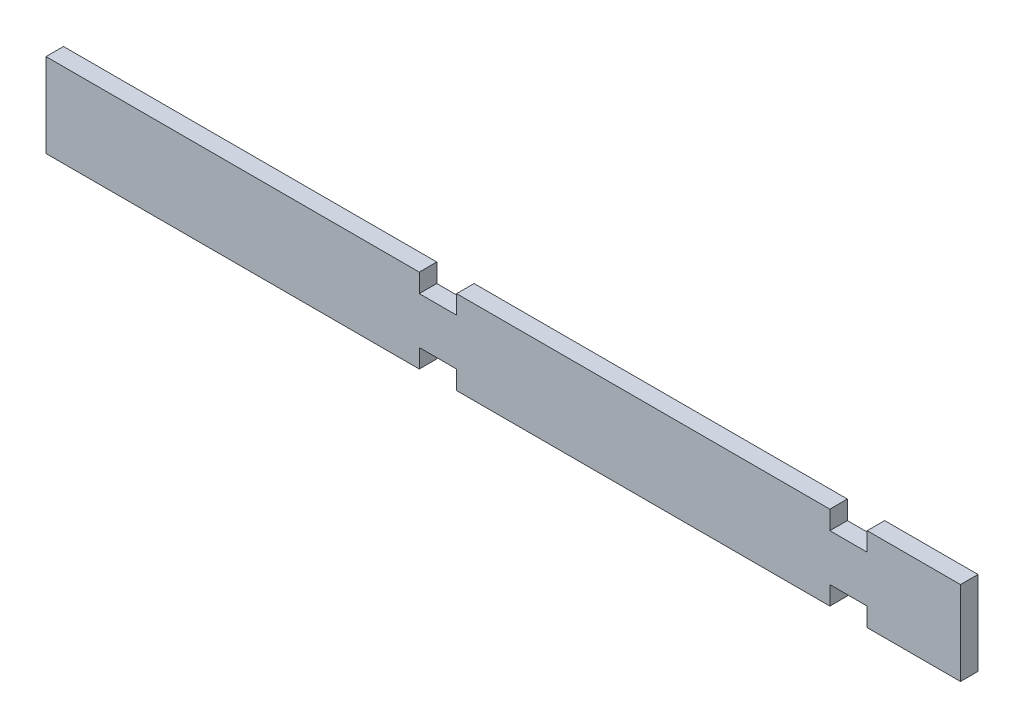
ISO-10303-21;
HEADER;
FILE_DESCRIPTION(('STEP AP214'),'2;1');
FILE_NAME('part.step','',(''),(''),'','','');
FILE_SCHEMA(('AUTOMOTIVE_DESIGN { 1 0 10303 214 1 1 1 1 }'));
ENDSEC;
DATA;
#1=APPLICATION_CONTEXT('core data for automotive mechanical design processes');
#2=APPLICATION_PROTOCOL_DEFINITION('international standard','automotive_design',2000,#1);
#3=PRODUCT_CONTEXT('',#1,'mechanical');
#4=PRODUCT('Part','Part','',(#3));
#5=PRODUCT_RELATED_PRODUCT_CATEGORY('part','',(#4));
#6=PRODUCT_DEFINITION_FORMATION('','',#4);
#7=PRODUCT_DEFINITION_CONTEXT('part definition',#1,'design');
#8=PRODUCT_DEFINITION('design','',#6,#7);
#9=PRODUCT_DEFINITION_SHAPE('','',#8);
#10=(LENGTH_UNIT() NAMED_UNIT(*) SI_UNIT(.MILLI.,.METRE.));
#11=(NAMED_UNIT(*) PLANE_ANGLE_UNIT() SI_UNIT($,.RADIAN.));
#12=(NAMED_UNIT(*) SI_UNIT($,.STERADIAN.) SOLID_ANGLE_UNIT());
#13=UNCERTAINTY_MEASURE_WITH_UNIT(LENGTH_MEASURE(1.E-05),#10,'distance_accuracy_value','');
#14=(GEOMETRIC_REPRESENTATION_CONTEXT(3) GLOBAL_UNCERTAINTY_ASSIGNED_CONTEXT((#13)) GLOBAL_UNIT_ASSIGNED_CONTEXT((#10,
#11,#12)) REPRESENTATION_CONTEXT('',''));
#15=CARTESIAN_POINT('',(0.,0.,0.));
#16=DIRECTION('',(0.,0.,1.));
#17=DIRECTION('',(1.,0.,0.));
#18=AXIS2_PLACEMENT_3D('',#15,#16,#17);
#19=CARTESIAN_POINT('',(0.,-5.71500000000001,1.190625));
#20=DIRECTION('',(0.,1.,0.));
#21=DIRECTION('',(-1.,0.,0.));
#22=AXIS2_PLACEMENT_3D('',#19,#20,#21);
#23=PLANE('',#22);
#24=DIRECTION('',(1.,0.,0.));
#25=VECTOR('',#24,1.);
#26=CARTESIAN_POINT('',(0.,-5.71500000000001,-1.190625));
#27=LINE('',#26,#25);
#28=CARTESIAN_POINT('',(-62.23,-5.71500000000001,-1.190625));
#29=VERTEX_POINT('',#28);
#30=CARTESIAN_POINT('',(-11.43,-5.71500000000001,-1.190625));
#31=VERTEX_POINT('',#30);
#32=EDGE_CURVE('E356',#29,#31,#27,.T.);
#33=ORIENTED_EDGE('',*,*,#32,.T.);
#34=DIRECTION('',(0.,0.,-1.));
#35=VECTOR('',#34,1.);
#36=CARTESIAN_POINT('',(-11.43,-5.71500000000001,1.190625));
#37=LINE('',#36,#35);
#38=CARTESIAN_POINT('',(-11.43,-5.71500000000001,1.190625));
#39=VERTEX_POINT('',#38);
#40=EDGE_CURVE('E11',#39,#31,#37,.T.);
#41=ORIENTED_EDGE('',*,*,#40,.F.);
#42=DIRECTION('',(1.,0.,0.));
#43=VECTOR('',#42,1.);
#44=CARTESIAN_POINT('',(0.,-5.71500000000001,1.190625));
#45=LINE('',#44,#43);
#46=CARTESIAN_POINT('',(-62.23,-5.71500000000001,1.190625));
#47=VERTEX_POINT('',#46);
#48=EDGE_CURVE('E239',#47,#39,#45,.T.);
#49=ORIENTED_EDGE('',*,*,#48,.F.);
#50=DIRECTION('',(0.,0.,-1.));
#51=VECTOR('',#50,1.);
#52=CARTESIAN_POINT('',(-62.23,-5.71500000000001,1.190625));
#53=LINE('',#52,#51);
#54=EDGE_CURVE('E61',#47,#29,#53,.T.);
#55=ORIENTED_EDGE('',*,*,#54,.T.);
#56=EDGE_LOOP('',(#33,#41,#49,#55));
#57=FACE_BOUND('',#56,.T.);
#58=ADVANCED_FACE('F43',(#57),#23,.F.);
#59=CARTESIAN_POINT('',(-11.43,0.,1.190625));
#60=DIRECTION('',(-1.,0.,0.));
#61=DIRECTION('',(0.,0.,1.));
#62=AXIS2_PLACEMENT_3D('',#59,#60,#61);
#63=PLANE('',#62);
#64=DIRECTION('',(0.,1.,0.));
#65=VECTOR('',#64,1.);
#66=CARTESIAN_POINT('',(-11.43,0.,-1.190625));
#67=LINE('',#66,#65);
#68=CARTESIAN_POINT('',(-11.43,-3.175,-1.190625));
#69=VERTEX_POINT('',#68);
#70=EDGE_CURVE('E348',#31,#69,#67,.T.);
#71=ORIENTED_EDGE('',*,*,#70,.T.);
#72=DIRECTION('',(0.,0.,-1.));
#73=VECTOR('',#72,1.);
#74=CARTESIAN_POINT('',(-11.43,-3.175,1.190625));
#75=LINE('',#74,#73);
#76=CARTESIAN_POINT('',(-11.43,-3.175,1.190625));
#77=VERTEX_POINT('',#76);
#78=EDGE_CURVE('E53',#77,#69,#75,.T.);
#79=ORIENTED_EDGE('',*,*,#78,.F.);
#80=DIRECTION('',(0.,1.,0.));
#81=VECTOR('',#80,1.);
#82=CARTESIAN_POINT('',(-11.43,0.,1.190625));
#83=LINE('',#82,#81);
#84=EDGE_CURVE('E135',#39,#77,#83,.T.);
#85=ORIENTED_EDGE('',*,*,#84,.F.);
#86=ORIENTED_EDGE('',*,*,#40,.T.);
#87=EDGE_LOOP('',(#71,#79,#85,#86));
#88=FACE_BOUND('',#87,.T.);
#89=ADVANCED_FACE('F45',(#88),#63,.F.);
#90=CARTESIAN_POINT('',(0.,-3.175,1.190625));
#91=DIRECTION('',(0.,1.,0.));
#92=DIRECTION('',(0.,0.,1.));
#93=AXIS2_PLACEMENT_3D('',#90,#91,#92);
#94=PLANE('',#93);
#95=DIRECTION('',(1.,0.,0.));
#96=VECTOR('',#95,1.);
#97=CARTESIAN_POINT('',(0.,-3.175,-1.190625));
#98=LINE('',#97,#96);
#99=CARTESIAN_POINT('',(-6.35000000000002,-3.175,-1.190625));
#100=VERTEX_POINT('',#99);
#101=EDGE_CURVE('E344',#69,#100,#98,.T.);
#102=ORIENTED_EDGE('',*,*,#101,.T.);
#103=DIRECTION('',(0.,0.,-1.));
#104=VECTOR('',#103,1.);
#105=CARTESIAN_POINT('',(-6.35000000000002,-3.175,1.190625));
#106=LINE('',#105,#104);
#107=CARTESIAN_POINT('',(-6.35000000000002,-3.175,1.190625));
#108=VERTEX_POINT('',#107);
#109=EDGE_CURVE('E334',#108,#100,#106,.T.);
#110=ORIENTED_EDGE('',*,*,#109,.F.);
#111=DIRECTION('',(1.,0.,0.));
#112=VECTOR('',#111,1.);
#113=CARTESIAN_POINT('',(0.,-3.175,1.190625));
#114=LINE('',#113,#112);
#115=EDGE_CURVE('E254',#77,#108,#114,.T.);
#116=ORIENTED_EDGE('',*,*,#115,.F.);
#117=ORIENTED_EDGE('',*,*,#78,.T.);
#118=EDGE_LOOP('',(#102,#110,#116,#117));
#119=FACE_BOUND('',#118,.T.);
#120=ADVANCED_FACE('F342',(#119),#94,.F.);
#121=CARTESIAN_POINT('',(-6.35000000000002,0.,1.190625));
#122=DIRECTION('',(-1.,0.,0.));
#123=DIRECTION('',(0.,0.,1.));
#124=AXIS2_PLACEMENT_3D('',#121,#122,#123);
#125=PLANE('',#124);
#126=DIRECTION('',(0.,1.,0.));
#127=VECTOR('',#126,1.);
#128=CARTESIAN_POINT('',(-6.35000000000002,0.,-1.190625));
#129=LINE('',#128,#127);
#130=CARTESIAN_POINT('',(-6.35000000000002,-5.71500000000001,-1.190625));
#131=VERTEX_POINT('',#130);
#132=EDGE_CURVE('E350',#131,#100,#129,.T.);
#133=ORIENTED_EDGE('',*,*,#132,.F.);
#134=DIRECTION('',(0.,0.,-1.));
#135=VECTOR('',#134,1.);
#136=CARTESIAN_POINT('',(-6.35000000000002,-5.71500000000001,1.190625));
#137=LINE('',#136,#135);
#138=CARTESIAN_POINT('',(-6.35000000000002,-5.71500000000001,1.190625));
#139=VERTEX_POINT('',#138);
#140=EDGE_CURVE('E280',#139,#131,#137,.T.);
#141=ORIENTED_EDGE('',*,*,#140,.F.);
#142=DIRECTION('',(0.,1.,0.));
#143=VECTOR('',#142,1.);
#144=CARTESIAN_POINT('',(-6.35000000000002,0.,1.190625));
#145=LINE('',#144,#143);
#146=EDGE_CURVE('E250',#139,#108,#145,.T.);
#147=ORIENTED_EDGE('',*,*,#146,.T.);
#148=ORIENTED_EDGE('',*,*,#109,.T.);
#149=EDGE_LOOP('',(#133,#141,#147,#148));
#150=FACE_BOUND('',#149,.T.);
#151=ADVANCED_FACE('F465',(#150),#125,.T.);
#152=CARTESIAN_POINT('',(44.45,-5.715,-1.190625));
#153=VERTEX_POINT('',#152);
#154=EDGE_CURVE('E276',#131,#153,#27,.T.);
#155=ORIENTED_EDGE('',*,*,#154,.T.);
#156=DIRECTION('',(0.,0.,-1.));
#157=VECTOR('',#156,1.);
#158=CARTESIAN_POINT('',(44.45,-5.715,1.190625));
#159=LINE('',#158,#157);
#160=CARTESIAN_POINT('',(44.45,-5.715,1.190625));
#161=VERTEX_POINT('',#160);
#162=EDGE_CURVE('E273',#161,#153,#159,.T.);
#163=ORIENTED_EDGE('',*,*,#162,.F.);
#164=EDGE_CURVE('E238',#139,#161,#45,.T.);
#165=ORIENTED_EDGE('',*,*,#164,.F.);
#166=ORIENTED_EDGE('',*,*,#140,.T.);
#167=EDGE_LOOP('',(#155,#163,#165,#166));
#168=FACE_BOUND('',#167,.T.);
#169=ADVANCED_FACE('F274',(#168),#23,.F.);
#170=CARTESIAN_POINT('',(44.45,-1.21430643318376E-13,1.190625));
#171=DIRECTION('',(-1.,0.,0.));
#172=DIRECTION('',(0.,-1.,0.));
#173=AXIS2_PLACEMENT_3D('',#170,#171,#172);
#174=PLANE('',#173);
#175=DIRECTION('',(0.,1.,0.));
#176=VECTOR('',#175,1.);
#177=CARTESIAN_POINT('',(44.45,-1.21430643318376E-13,-1.190625));
#178=LINE('',#177,#176);
#179=CARTESIAN_POINT('',(44.45,-3.175,-1.190625));
#180=VERTEX_POINT('',#179);
#181=EDGE_CURVE('E286',#153,#180,#178,.T.);
#182=ORIENTED_EDGE('',*,*,#181,.T.);
#183=DIRECTION('',(0.,0.,-1.));
#184=VECTOR('',#183,1.);
#185=CARTESIAN_POINT('',(44.45,-3.175,1.190625));
#186=LINE('',#185,#184);
#187=CARTESIAN_POINT('',(44.45,-3.175,1.190625));
#188=VERTEX_POINT('',#187);
#189=EDGE_CURVE('E281',#188,#180,#186,.T.);
#190=ORIENTED_EDGE('',*,*,#189,.F.);
#191=DIRECTION('',(0.,1.,0.));
#192=VECTOR('',#191,1.);
#193=CARTESIAN_POINT('',(44.45,-1.21430643318376E-13,1.190625));
#194=LINE('',#193,#192);
#195=EDGE_CURVE('E247',#161,#188,#194,.T.);
#196=ORIENTED_EDGE('',*,*,#195,.F.);
#197=ORIENTED_EDGE('',*,*,#162,.T.);
#198=EDGE_LOOP('',(#182,#190,#196,#197));
#199=FACE_BOUND('',#198,.T.);
#200=ADVANCED_FACE('F283',(#199),#174,.F.);
#201=CARTESIAN_POINT('',(0.,-3.175,1.190625));
#202=DIRECTION('',(0.,1.,0.));
#203=DIRECTION('',(0.,0.,1.));
#204=AXIS2_PLACEMENT_3D('',#201,#202,#203);
#205=PLANE('',#204);
#206=DIRECTION('',(1.,0.,0.));
#207=VECTOR('',#206,1.);
#208=CARTESIAN_POINT('',(0.,-3.175,-1.190625));
#209=LINE('',#208,#207);
#210=CARTESIAN_POINT('',(49.53,-3.175,-1.190625));
#211=VERTEX_POINT('',#210);
#212=EDGE_CURVE('E362',#180,#211,#209,.T.);
#213=ORIENTED_EDGE('',*,*,#212,.T.);
#214=DIRECTION('',(0.,0.,-1.));
#215=VECTOR('',#214,1.);
#216=CARTESIAN_POINT('',(49.53,-3.175,1.190625));
#217=LINE('',#216,#215);
#218=CARTESIAN_POINT('',(49.53,-3.175,1.190625));
#219=VERTEX_POINT('',#218);
#220=EDGE_CURVE('E291',#219,#211,#217,.T.);
#221=ORIENTED_EDGE('',*,*,#220,.F.);
#222=DIRECTION('',(1.,0.,0.));
#223=VECTOR('',#222,1.);
#224=CARTESIAN_POINT('',(0.,-3.175,1.190625));
#225=LINE('',#224,#223);
#226=EDGE_CURVE('E244',#188,#219,#225,.T.);
#227=ORIENTED_EDGE('',*,*,#226,.F.);
#228=ORIENTED_EDGE('',*,*,#189,.T.);
#229=EDGE_LOOP('',(#213,#221,#227,#228));
#230=FACE_BOUND('',#229,.T.);
#231=ADVANCED_FACE('F294',(#230),#205,.F.);
#232=CARTESIAN_POINT('',(49.53,-1.35308431126191E-13,1.190625));
#233=DIRECTION('',(-1.,0.,0.));
#234=DIRECTION('',(0.,-1.,0.));
#235=AXIS2_PLACEMENT_3D('',#232,#233,#234);
#236=PLANE('',#235);
#237=DIRECTION('',(0.,1.,0.));
#238=VECTOR('',#237,1.);
#239=CARTESIAN_POINT('',(49.53,-1.35308431126191E-13,-1.190625));
#240=LINE('',#239,#238);
#241=CARTESIAN_POINT('',(49.53,-5.715,-1.190625));
#242=VERTEX_POINT('',#241);
#243=EDGE_CURVE('E303',#242,#211,#240,.T.);
#244=ORIENTED_EDGE('',*,*,#243,.F.);
#245=DIRECTION('',(0.,0.,-1.));
#246=VECTOR('',#245,1.);
#247=CARTESIAN_POINT('',(49.53,-5.715,1.190625));
#248=LINE('',#247,#246);
#249=CARTESIAN_POINT('',(49.53,-5.715,1.190625));
#250=VERTEX_POINT('',#249);
#251=EDGE_CURVE('E301',#250,#242,#248,.T.);
#252=ORIENTED_EDGE('',*,*,#251,.F.);
#253=DIRECTION('',(0.,1.,0.));
#254=VECTOR('',#253,1.);
#255=CARTESIAN_POINT('',(49.53,-1.35308431126191E-13,1.190625));
#256=LINE('',#255,#254);
#257=EDGE_CURVE('E236',#250,#219,#256,.T.);
#258=ORIENTED_EDGE('',*,*,#257,.T.);
#259=ORIENTED_EDGE('',*,*,#220,.T.);
#260=EDGE_LOOP('',(#244,#252,#258,#259));
#261=FACE_BOUND('',#260,.T.);
#262=ADVANCED_FACE('F300',(#261),#236,.T.);
#263=CARTESIAN_POINT('',(62.23,-5.715,-1.190625));
#264=VERTEX_POINT('',#263);
#265=EDGE_CURVE('E311',#242,#264,#27,.T.);
#266=ORIENTED_EDGE('',*,*,#265,.T.);
#267=DIRECTION('',(0.,0.,-1.));
#268=VECTOR('',#267,1.);
#269=CARTESIAN_POINT('',(62.23,-5.715,1.190625));
#270=LINE('',#269,#268);
#271=CARTESIAN_POINT('',(62.23,-5.715,1.190625));
#272=VERTEX_POINT('',#271);
#273=EDGE_CURVE('E307',#272,#264,#270,.T.);
#274=ORIENTED_EDGE('',*,*,#273,.F.);
#275=EDGE_CURVE('E232',#250,#272,#45,.T.);
#276=ORIENTED_EDGE('',*,*,#275,.F.);
#277=ORIENTED_EDGE('',*,*,#251,.T.);
#278=EDGE_LOOP('',(#266,#274,#276,#277));
#279=FACE_BOUND('',#278,.T.);
#280=ADVANCED_FACE('F309',(#279),#23,.F.);
#281=CARTESIAN_POINT('',(62.23,0.,1.190625));
#282=DIRECTION('',(-1.,0.,0.));
#283=DIRECTION('',(0.,0.,1.));
#284=AXIS2_PLACEMENT_3D('',#281,#282,#283);
#285=PLANE('',#284);
#286=DIRECTION('',(0.,1.,0.));
#287=VECTOR('',#286,1.);
#288=CARTESIAN_POINT('',(62.23,0.,-1.190625));
#289=LINE('',#288,#287);
#290=CARTESIAN_POINT('',(62.23,5.715,-1.190625));
#291=VERTEX_POINT('',#290);
#292=EDGE_CURVE('E319',#264,#291,#289,.T.);
#293=ORIENTED_EDGE('',*,*,#292,.T.);
#294=DIRECTION('',(0.,0.,-1.));
#295=VECTOR('',#294,1.);
#296=CARTESIAN_POINT('',(62.23,5.715,1.190625));
#297=LINE('',#296,#295);
#298=CARTESIAN_POINT('',(62.23,5.715,1.190625));
#299=VERTEX_POINT('',#298);
#300=EDGE_CURVE('E316',#299,#291,#297,.T.);
#301=ORIENTED_EDGE('',*,*,#300,.F.);
#302=DIRECTION('',(0.,1.,0.));
#303=VECTOR('',#302,1.);
#304=CARTESIAN_POINT('',(62.23,0.,1.190625));
#305=LINE('',#304,#303);
#306=EDGE_CURVE('E226',#272,#299,#305,.T.);
#307=ORIENTED_EDGE('',*,*,#306,.F.);
#308=ORIENTED_EDGE('',*,*,#273,.T.);
#309=EDGE_LOOP('',(#293,#301,#307,#308));
#310=FACE_BOUND('',#309,.T.);
#311=ADVANCED_FACE('F318',(#310),#285,.F.);
#312=CARTESIAN_POINT('',(0.,5.715,1.190625));
#313=DIRECTION('',(0.,1.,0.));
#314=DIRECTION('',(0.,0.,1.));
#315=AXIS2_PLACEMENT_3D('',#312,#313,#314);
#316=PLANE('',#315);
#317=DIRECTION('',(1.,0.,0.));
#318=VECTOR('',#317,1.);
#319=CARTESIAN_POINT('',(0.,5.715,-1.190625));
#320=LINE('',#319,#318);
#321=CARTESIAN_POINT('',(49.53,5.715,-1.190625));
#322=VERTEX_POINT('',#321);
#323=EDGE_CURVE('E369',#322,#291,#320,.T.);
#324=ORIENTED_EDGE('',*,*,#323,.F.);
#325=DIRECTION('',(0.,0.,-1.));
#326=VECTOR('',#325,1.);
#327=CARTESIAN_POINT('',(49.53,5.715,1.190625));
#328=LINE('',#327,#326);
#329=CARTESIAN_POINT('',(49.53,5.715,1.190625));
#330=VERTEX_POINT('',#329);
#331=EDGE_CURVE('E323',#330,#322,#328,.T.);
#332=ORIENTED_EDGE('',*,*,#331,.F.);
#333=DIRECTION('',(1.,0.,0.));
#334=VECTOR('',#333,1.);
#335=CARTESIAN_POINT('',(0.,5.715,1.190625));
#336=LINE('',#335,#334);
#337=EDGE_CURVE('E214',#330,#299,#336,.T.);
#338=ORIENTED_EDGE('',*,*,#337,.T.);
#339=ORIENTED_EDGE('',*,*,#300,.T.);
#340=EDGE_LOOP('',(#324,#332,#338,#339));
#341=FACE_BOUND('',#340,.T.);
#342=ADVANCED_FACE('F454',(#341),#316,.T.);
#343=CARTESIAN_POINT('',(49.53,1.35308431126191E-13,1.190625));
#344=DIRECTION('',(1.,0.,0.));
#345=DIRECTION('',(0.,1.,0.));
#346=AXIS2_PLACEMENT_3D('',#343,#344,#345);
#347=PLANE('',#346);
#348=DIRECTION('',(0.,-1.,0.));
#349=VECTOR('',#348,1.);
#350=CARTESIAN_POINT('',(49.53,1.35308431126191E-13,-1.190625));
#351=LINE('',#350,#349);
#352=CARTESIAN_POINT('',(49.53,3.175,-1.190625));
#353=VERTEX_POINT('',#352);
#354=EDGE_CURVE('E372',#322,#353,#351,.T.);
#355=ORIENTED_EDGE('',*,*,#354,.T.);
#356=DIRECTION('',(0.,0.,-1.));
#357=VECTOR('',#356,1.);
#358=CARTESIAN_POINT('',(49.53,3.175,1.190625));
#359=LINE('',#358,#357);
#360=CARTESIAN_POINT('',(49.53,3.175,1.190625));
#361=VERTEX_POINT('',#360);
#362=EDGE_CURVE('E326',#361,#353,#359,.T.);
#363=ORIENTED_EDGE('',*,*,#362,.F.);
#364=DIRECTION('',(0.,-1.,0.));
#365=VECTOR('',#364,1.);
#366=CARTESIAN_POINT('',(49.53,1.35308431126191E-13,1.190625));
#367=LINE('',#366,#365);
#368=EDGE_CURVE('E225',#330,#361,#367,.T.);
#369=ORIENTED_EDGE('',*,*,#368,.F.);
#370=ORIENTED_EDGE('',*,*,#331,.T.);
#371=EDGE_LOOP('',(#355,#363,#369,#370));
#372=FACE_BOUND('',#371,.T.);
#373=ADVANCED_FACE('F422',(#372),#347,.F.);
#374=CARTESIAN_POINT('',(0.,3.175,1.190625));
#375=DIRECTION('',(0.,1.,0.));
#376=DIRECTION('',(0.,0.,1.));
#377=AXIS2_PLACEMENT_3D('',#374,#375,#376);
#378=PLANE('',#377);
#379=DIRECTION('',(1.,0.,0.));
#380=VECTOR('',#379,1.);
#381=CARTESIAN_POINT('',(0.,3.175,-1.190625));
#382=LINE('',#381,#380);
#383=CARTESIAN_POINT('',(44.45,3.175,-1.190625));
#384=VERTEX_POINT('',#383);
#385=EDGE_CURVE('E377',#384,#353,#382,.T.);
#386=ORIENTED_EDGE('',*,*,#385,.F.);
#387=DIRECTION('',(0.,0.,-1.));
#388=VECTOR('',#387,1.);
#389=CARTESIAN_POINT('',(44.45,3.175,1.190625));
#390=LINE('',#389,#388);
#391=CARTESIAN_POINT('',(44.45,3.175,1.190625));
#392=VERTEX_POINT('',#391);
#393=EDGE_CURVE('E410',#392,#384,#390,.T.);
#394=ORIENTED_EDGE('',*,*,#393,.F.);
#395=DIRECTION('',(1.,0.,0.));
#396=VECTOR('',#395,1.);
#397=CARTESIAN_POINT('',(0.,3.175,1.190625));
#398=LINE('',#397,#396);
#399=EDGE_CURVE('E231',#392,#361,#398,.T.);
#400=ORIENTED_EDGE('',*,*,#399,.T.);
#401=ORIENTED_EDGE('',*,*,#362,.T.);
#402=EDGE_LOOP('',(#386,#394,#400,#401));
#403=FACE_BOUND('',#402,.T.);
#404=ADVANCED_FACE('F417',(#403),#378,.T.);
#405=CARTESIAN_POINT('',(44.45,1.21430643318376E-13,1.190625));
#406=DIRECTION('',(1.,0.,0.));
#407=DIRECTION('',(0.,1.,0.));
#408=AXIS2_PLACEMENT_3D('',#405,#406,#407);
#409=PLANE('',#408);
#410=DIRECTION('',(0.,-1.,0.));
#411=VECTOR('',#410,1.);
#412=CARTESIAN_POINT('',(44.45,1.21430643318376E-13,-1.190625));
#413=LINE('',#412,#411);
#414=CARTESIAN_POINT('',(44.45,5.715,-1.190625));
#415=VERTEX_POINT('',#414);
#416=EDGE_CURVE('E381',#415,#384,#413,.T.);
#417=ORIENTED_EDGE('',*,*,#416,.F.);
#418=DIRECTION('',(0.,0.,-1.));
#419=VECTOR('',#418,1.);
#420=CARTESIAN_POINT('',(44.45,5.715,1.190625));
#421=LINE('',#420,#419);
#422=CARTESIAN_POINT('',(44.45,5.715,1.190625));
#423=VERTEX_POINT('',#422);
#424=EDGE_CURVE('E407',#423,#415,#421,.T.);
#425=ORIENTED_EDGE('',*,*,#424,.F.);
#426=DIRECTION('',(0.,-1.,0.));
#427=VECTOR('',#426,1.);
#428=CARTESIAN_POINT('',(44.45,1.21430643318376E-13,1.190625));
#429=LINE('',#428,#427);
#430=EDGE_CURVE('E222',#423,#392,#429,.T.);
#431=ORIENTED_EDGE('',*,*,#430,.T.);
#432=ORIENTED_EDGE('',*,*,#393,.T.);
#433=EDGE_LOOP('',(#417,#425,#431,#432));
#434=FACE_BOUND('',#433,.T.);
#435=ADVANCED_FACE('F428',(#434),#409,.T.);
#436=CARTESIAN_POINT('',(-6.35000000000002,5.715,-1.190625));
#437=VERTEX_POINT('',#436);
#438=EDGE_CURVE('E373',#437,#415,#320,.T.);
#439=ORIENTED_EDGE('',*,*,#438,.F.);
#440=DIRECTION('',(0.,0.,-1.));
#441=VECTOR('',#440,1.);
#442=CARTESIAN_POINT('',(-6.35000000000002,5.715,1.190625));
#443=LINE('',#442,#441);
#444=CARTESIAN_POINT('',(-6.35000000000002,5.715,1.190625));
#445=VERTEX_POINT('',#444);
#446=EDGE_CURVE('E404',#445,#437,#443,.T.);
#447=ORIENTED_EDGE('',*,*,#446,.F.);
#448=EDGE_CURVE('E213',#445,#423,#336,.T.);
#449=ORIENTED_EDGE('',*,*,#448,.T.);
#450=ORIENTED_EDGE('',*,*,#424,.T.);
#451=EDGE_LOOP('',(#439,#447,#449,#450));
#452=FACE_BOUND('',#451,.T.);
#453=ADVANCED_FACE('F455',(#452),#316,.T.);
#454=CARTESIAN_POINT('',(-6.35000000000002,0.,1.190625));
#455=DIRECTION('',(1.,0.,0.));
#456=DIRECTION('',(0.,0.,-1.));
#457=AXIS2_PLACEMENT_3D('',#454,#455,#456);
#458=PLANE('',#457);
#459=DIRECTION('',(0.,-1.,0.));
#460=VECTOR('',#459,1.);
#461=CARTESIAN_POINT('',(-6.35000000000002,0.,-1.190625));
#462=LINE('',#461,#460);
#463=CARTESIAN_POINT('',(-6.35000000000002,3.175,-1.190625));
#464=VERTEX_POINT('',#463);
#465=EDGE_CURVE('E385',#437,#464,#462,.T.);
#466=ORIENTED_EDGE('',*,*,#465,.T.);
#467=DIRECTION('',(0.,0.,-1.));
#468=VECTOR('',#467,1.);
#469=CARTESIAN_POINT('',(-6.35000000000002,3.175,1.190625));
#470=LINE('',#469,#468);
#471=CARTESIAN_POINT('',(-6.35000000000002,3.175,1.190625));
#472=VERTEX_POINT('',#471);
#473=EDGE_CURVE('E401',#472,#464,#470,.T.);
#474=ORIENTED_EDGE('',*,*,#473,.F.);
#475=DIRECTION('',(0.,-1.,0.));
#476=VECTOR('',#475,1.);
#477=CARTESIAN_POINT('',(-6.35000000000002,0.,1.190625));
#478=LINE('',#477,#476);
#479=EDGE_CURVE('E221',#445,#472,#478,.T.);
#480=ORIENTED_EDGE('',*,*,#479,.F.);
#481=ORIENTED_EDGE('',*,*,#446,.T.);
#482=EDGE_LOOP('',(#466,#474,#480,#481));
#483=FACE_BOUND('',#482,.T.);
#484=ADVANCED_FACE('F563',(#483),#458,.F.);
#485=CARTESIAN_POINT('',(0.,3.175,1.190625));
#486=DIRECTION('',(0.,1.,0.));
#487=DIRECTION('',(0.,0.,1.));
#488=AXIS2_PLACEMENT_3D('',#485,#486,#487);
#489=PLANE('',#488);
#490=DIRECTION('',(1.,0.,0.));
#491=VECTOR('',#490,1.);
#492=CARTESIAN_POINT('',(0.,3.175,-1.190625));
#493=LINE('',#492,#491);
#494=CARTESIAN_POINT('',(-11.43,3.175,-1.190625));
#495=VERTEX_POINT('',#494);
#496=EDGE_CURVE('E389',#495,#464,#493,.T.);
#497=ORIENTED_EDGE('',*,*,#496,.F.);
#498=DIRECTION('',(0.,0.,-1.));
#499=VECTOR('',#498,1.);
#500=CARTESIAN_POINT('',(-11.43,3.175,1.190625));
#501=LINE('',#500,#499);
#502=CARTESIAN_POINT('',(-11.43,3.175,1.190625));
#503=VERTEX_POINT('',#502);
#504=EDGE_CURVE('E197',#503,#495,#501,.T.);
#505=ORIENTED_EDGE('',*,*,#504,.F.);
#506=DIRECTION('',(1.,0.,0.));
#507=VECTOR('',#506,1.);
#508=CARTESIAN_POINT('',(0.,3.175,1.190625));
#509=LINE('',#508,#507);
#510=EDGE_CURVE('E206',#503,#472,#509,.T.);
#511=ORIENTED_EDGE('',*,*,#510,.T.);
#512=ORIENTED_EDGE('',*,*,#473,.T.);
#513=EDGE_LOOP('',(#497,#505,#511,#512));
#514=FACE_BOUND('',#513,.T.);
#515=ADVANCED_FACE('F573',(#514),#489,.T.);
#516=CARTESIAN_POINT('',(-11.43,0.,1.190625));
#517=DIRECTION('',(1.,0.,0.));
#518=DIRECTION('',(0.,0.,-1.));
#519=AXIS2_PLACEMENT_3D('',#516,#517,#518);
#520=PLANE('',#519);
#521=DIRECTION('',(0.,-1.,0.));
#522=VECTOR('',#521,1.);
#523=CARTESIAN_POINT('',(-11.43,0.,-1.190625));
#524=LINE('',#523,#522);
#525=CARTESIAN_POINT('',(-11.43,5.715,-1.190625));
#526=VERTEX_POINT('',#525);
#527=EDGE_CURVE('E192',#526,#495,#524,.T.);
#528=ORIENTED_EDGE('',*,*,#527,.F.);
#529=DIRECTION('',(0.,0.,-1.));
#530=VECTOR('',#529,1.);
#531=CARTESIAN_POINT('',(-11.43,5.715,1.190625));
#532=LINE('',#531,#530);
#533=CARTESIAN_POINT('',(-11.43,5.715,1.190625));
#534=VERTEX_POINT('',#533);
#535=EDGE_CURVE('E187',#534,#526,#532,.T.);
#536=ORIENTED_EDGE('',*,*,#535,.F.);
#537=DIRECTION('',(0.,-1.,0.));
#538=VECTOR('',#537,1.);
#539=CARTESIAN_POINT('',(-11.43,0.,1.190625));
#540=LINE('',#539,#538);
#541=EDGE_CURVE('E190',#534,#503,#540,.T.);
#542=ORIENTED_EDGE('',*,*,#541,.T.);
#543=ORIENTED_EDGE('',*,*,#504,.T.);
#544=EDGE_LOOP('',(#528,#536,#542,#543));
#545=FACE_BOUND('',#544,.T.);
#546=ADVANCED_FACE('F189',(#545),#520,.T.);
#547=CARTESIAN_POINT('',(-62.23,5.715,-1.190625));
#548=VERTEX_POINT('',#547);
#549=EDGE_CURVE('E263',#548,#526,#320,.T.);
#550=ORIENTED_EDGE('',*,*,#549,.F.);
#551=DIRECTION('',(0.,0.,-1.));
#552=VECTOR('',#551,1.);
#553=CARTESIAN_POINT('',(-62.23,5.715,1.190625));
#554=LINE('',#553,#552);
#555=CARTESIAN_POINT('',(-62.23,5.715,1.190625));
#556=VERTEX_POINT('',#555);
#557=EDGE_CURVE('E123',#556,#548,#554,.T.);
#558=ORIENTED_EDGE('',*,*,#557,.F.);
#559=EDGE_CURVE('E204',#556,#534,#336,.T.);
#560=ORIENTED_EDGE('',*,*,#559,.T.);
#561=ORIENTED_EDGE('',*,*,#535,.T.);
#562=EDGE_LOOP('',(#550,#558,#560,#561));
#563=FACE_BOUND('',#562,.T.);
#564=ADVANCED_FACE('F209',(#563),#316,.T.);
#565=CARTESIAN_POINT('',(-62.23,0.,1.190625));
#566=DIRECTION('',(-1.,0.,0.));
#567=DIRECTION('',(0.,0.,1.));
#568=AXIS2_PLACEMENT_3D('',#565,#566,#567);
#569=PLANE('',#568);
#570=DIRECTION('',(0.,1.,0.));
#571=VECTOR('',#570,1.);
#572=CARTESIAN_POINT('',(-62.23,0.,-1.190625));
#573=LINE('',#572,#571);
#574=EDGE_CURVE('E259',#29,#548,#573,.T.);
#575=ORIENTED_EDGE('',*,*,#574,.F.);
#576=ORIENTED_EDGE('',*,*,#54,.F.);
#577=DIRECTION('',(0.,1.,0.));
#578=VECTOR('',#577,1.);
#579=CARTESIAN_POINT('',(-62.23,0.,1.190625));
#580=LINE('',#579,#578);
#581=EDGE_CURVE('E211',#47,#556,#580,.T.);
#582=ORIENTED_EDGE('',*,*,#581,.T.);
#583=ORIENTED_EDGE('',*,*,#557,.T.);
#584=EDGE_LOOP('',(#575,#576,#582,#583));
#585=FACE_BOUND('',#584,.T.);
#586=ADVANCED_FACE('F445',(#585),#569,.T.);
#587=CARTESIAN_POINT('',(0.,0.,1.190625));
#588=DIRECTION('',(0.,0.,1.));
#589=DIRECTION('',(1.,0.,0.));
#590=AXIS2_PLACEMENT_3D('',#587,#588,#589);
#591=PLANE('',#590);
#592=ORIENTED_EDGE('',*,*,#48,.T.);
#593=ORIENTED_EDGE('',*,*,#84,.T.);
#594=ORIENTED_EDGE('',*,*,#115,.T.);
#595=ORIENTED_EDGE('',*,*,#146,.F.);
#596=ORIENTED_EDGE('',*,*,#164,.T.);
#597=ORIENTED_EDGE('',*,*,#195,.T.);
#598=ORIENTED_EDGE('',*,*,#226,.T.);
#599=ORIENTED_EDGE('',*,*,#257,.F.);
#600=ORIENTED_EDGE('',*,*,#275,.T.);
#601=ORIENTED_EDGE('',*,*,#306,.T.);
#602=ORIENTED_EDGE('',*,*,#337,.F.);
#603=ORIENTED_EDGE('',*,*,#368,.T.);
#604=ORIENTED_EDGE('',*,*,#399,.F.);
#605=ORIENTED_EDGE('',*,*,#430,.F.);
#606=ORIENTED_EDGE('',*,*,#448,.F.);
#607=ORIENTED_EDGE('',*,*,#479,.T.);
#608=ORIENTED_EDGE('',*,*,#510,.F.);
#609=ORIENTED_EDGE('',*,*,#541,.F.);
#610=ORIENTED_EDGE('',*,*,#559,.F.);
#611=ORIENTED_EDGE('',*,*,#581,.F.);
#612=EDGE_LOOP('',(#592,#593,#594,#595,#596,#597,#598,#599,#600,#601,#602,#603,#604,#605,#606,
#607,#608,#609,#610,#611));
#613=FACE_BOUND('',#612,.T.);
#614=ADVANCED_FACE('F202',(#613),#591,.T.);
#615=CARTESIAN_POINT('',(0.,0.,-1.190625));
#616=DIRECTION('',(0.,0.,1.));
#617=DIRECTION('',(1.,0.,0.));
#618=AXIS2_PLACEMENT_3D('',#615,#616,#617);
#619=PLANE('',#618);
#620=ORIENTED_EDGE('',*,*,#32,.F.);
#621=ORIENTED_EDGE('',*,*,#574,.T.);
#622=ORIENTED_EDGE('',*,*,#549,.T.);
#623=ORIENTED_EDGE('',*,*,#527,.T.);
#624=ORIENTED_EDGE('',*,*,#496,.T.);
#625=ORIENTED_EDGE('',*,*,#465,.F.);
#626=ORIENTED_EDGE('',*,*,#438,.T.);
#627=ORIENTED_EDGE('',*,*,#416,.T.);
#628=ORIENTED_EDGE('',*,*,#385,.T.);
#629=ORIENTED_EDGE('',*,*,#354,.F.);
#630=ORIENTED_EDGE('',*,*,#323,.T.);
#631=ORIENTED_EDGE('',*,*,#292,.F.);
#632=ORIENTED_EDGE('',*,*,#265,.F.);
#633=ORIENTED_EDGE('',*,*,#243,.T.);
#634=ORIENTED_EDGE('',*,*,#212,.F.);
#635=ORIENTED_EDGE('',*,*,#181,.F.);
#636=ORIENTED_EDGE('',*,*,#154,.F.);
#637=ORIENTED_EDGE('',*,*,#132,.T.);
#638=ORIENTED_EDGE('',*,*,#101,.F.);
#639=ORIENTED_EDGE('',*,*,#70,.F.);
#640=EDGE_LOOP('',(#620,#621,#622,#623,#624,#625,#626,#627,#628,#629,#630,#631,#632,#633,#634,
#635,#636,#637,#638,#639));
#641=FACE_BOUND('',#640,.T.);
#642=ADVANCED_FACE('F347',(#641),#619,.F.);
#643=CLOSED_SHELL('',(#58,#89,#120,#151,#169,#200,#231,#262,#280,#311,#342,#373,#404,#435,#453,
#484,#515,#546,#564,#586,#614,#642));
#644=MANIFOLD_SOLID_BREP('B2',#643);
#645=ADVANCED_BREP_SHAPE_REPRESENTATION('',(#18,#644),#14);
#646=SHAPE_DEFINITION_REPRESENTATION(#9,#645);
ENDSEC;
END-ISO-10303-21;
